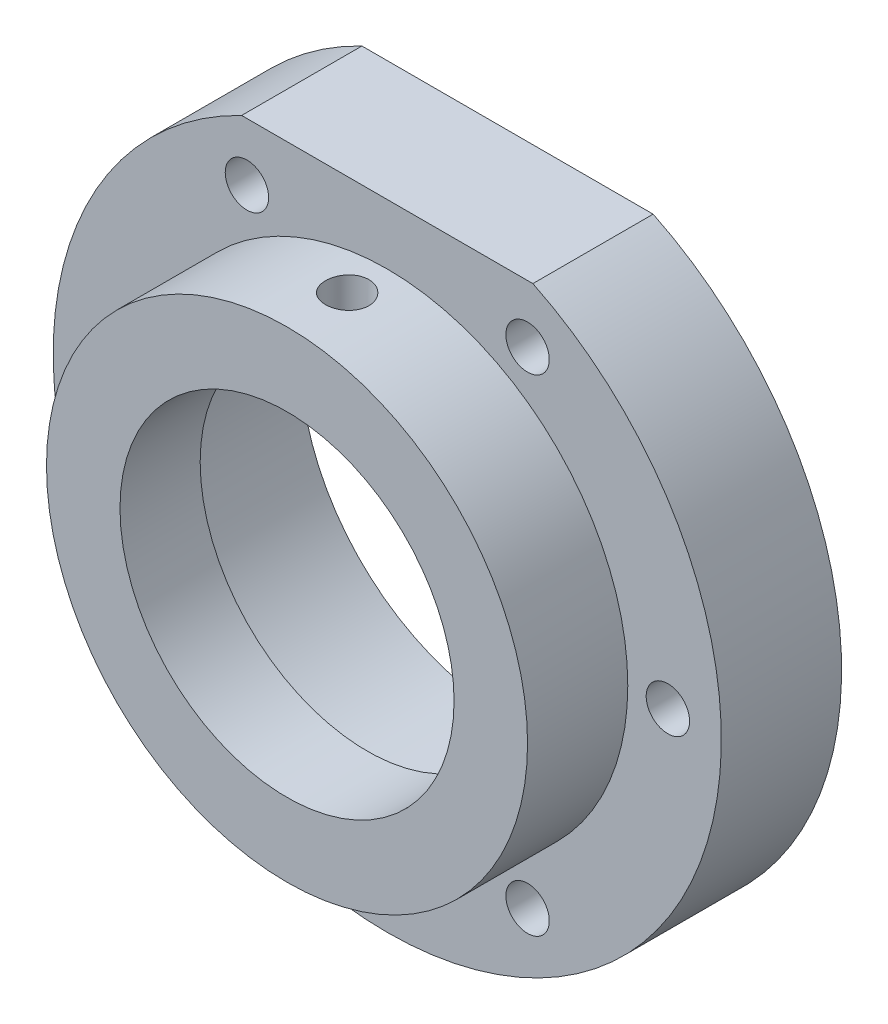
ISO-10303-21;
HEADER;
FILE_DESCRIPTION(('STEP AP214'),'2;1');
FILE_NAME('part.step','',(''),(''),'','','');
FILE_SCHEMA(('AUTOMOTIVE_DESIGN { 1 0 10303 214 1 1 1 1 }'));
ENDSEC;
DATA;
#1=APPLICATION_CONTEXT('core data for automotive mechanical design processes');
#2=APPLICATION_PROTOCOL_DEFINITION('international standard','automotive_design',2000,#1);
#3=PRODUCT_CONTEXT('',#1,'mechanical');
#4=PRODUCT('Part','Part','',(#3));
#5=PRODUCT_RELATED_PRODUCT_CATEGORY('part','',(#4));
#6=PRODUCT_DEFINITION_FORMATION('','',#4);
#7=PRODUCT_DEFINITION_CONTEXT('part definition',#1,'design');
#8=PRODUCT_DEFINITION('design','',#6,#7);
#9=PRODUCT_DEFINITION_SHAPE('','',#8);
#10=(LENGTH_UNIT() NAMED_UNIT(*) SI_UNIT(.MILLI.,.METRE.));
#11=(NAMED_UNIT(*) PLANE_ANGLE_UNIT() SI_UNIT($,.RADIAN.));
#12=(NAMED_UNIT(*) SI_UNIT($,.STERADIAN.) SOLID_ANGLE_UNIT());
#13=UNCERTAINTY_MEASURE_WITH_UNIT(LENGTH_MEASURE(1.E-05),#10,'distance_accuracy_value','');
#14=(GEOMETRIC_REPRESENTATION_CONTEXT(3) GLOBAL_UNCERTAINTY_ASSIGNED_CONTEXT((#13)) GLOBAL_UNIT_ASSIGNED_CONTEXT((#10,
#11,#12)) REPRESENTATION_CONTEXT('',''));
#15=CARTESIAN_POINT('',(0.,0.,0.));
#16=DIRECTION('',(0.,0.,1.));
#17=DIRECTION('',(1.,0.,0.));
#18=AXIS2_PLACEMENT_3D('',#15,#16,#17);
#19=CARTESIAN_POINT('',(-20.9999999999997,36.3730669589466,21.));
#20=DIRECTION('',(0.,0.,-1.));
#21=DIRECTION('',(0.499999999999992,-0.866025403784443,0.));
#22=AXIS2_PLACEMENT_3D('',#19,#20,#21);
#23=CYLINDRICAL_SURFACE('',#22,3.25);
#24=CARTESIAN_POINT('',(-20.9999999999997,36.3730669589466,18.));
#25=DIRECTION('',(0.,0.,1.));
#26=DIRECTION('',(-0.499999999999992,0.866025403784443,0.));
#27=AXIS2_PLACEMENT_3D('',#24,#25,#26);
#28=CIRCLE('',#27,3.25);
#29=CARTESIAN_POINT('',(-22.6249999999996,39.1876495212461,18.));
#30=VERTEX_POINT('',#29);
#31=EDGE_CURVE('E160',#30,#30,#28,.T.);
#32=ORIENTED_EDGE('',*,*,#31,.T.);
#33=EDGE_LOOP('',(#32));
#34=FACE_BOUND('',#33,.T.);
#35=CARTESIAN_POINT('',(-20.9999999999997,36.3730669589466,6.));
#36=DIRECTION('',(0.,0.,-1.));
#37=DIRECTION('',(-1.,0.,0.));
#38=AXIS2_PLACEMENT_3D('',#35,#36,#37);
#39=CIRCLE('',#38,3.25);
#40=CARTESIAN_POINT('',(-24.2499999999997,36.3730669589466,6.));
#41=VERTEX_POINT('',#40);
#42=EDGE_CURVE('E122',#41,#41,#39,.F.);
#43=ORIENTED_EDGE('',*,*,#42,.F.);
#44=EDGE_LOOP('',(#43));
#45=FACE_BOUND('',#44,.T.);
#46=ADVANCED_FACE('F34',(#34,#45),#23,.F.);
#47=CARTESIAN_POINT('',(-42.,0.,21.));
#48=DIRECTION('',(0.,0.,-1.));
#49=DIRECTION('',(1.,0.,0.));
#50=AXIS2_PLACEMENT_3D('',#47,#48,#49);
#51=CYLINDRICAL_SURFACE('',#50,3.25);
#52=CARTESIAN_POINT('',(-42.,0.,18.));
#53=DIRECTION('',(0.,0.,1.));
#54=DIRECTION('',(-1.,0.,0.));
#55=AXIS2_PLACEMENT_3D('',#52,#53,#54);
#56=CIRCLE('',#55,3.25);
#57=CARTESIAN_POINT('',(-45.25,0.,18.));
#58=VERTEX_POINT('',#57);
#59=EDGE_CURVE('E163',#58,#58,#56,.T.);
#60=ORIENTED_EDGE('',*,*,#59,.T.);
#61=EDGE_LOOP('',(#60));
#62=FACE_BOUND('',#61,.T.);
#63=CARTESIAN_POINT('',(-42.,0.,6.));
#64=DIRECTION('',(0.,0.,-1.));
#65=DIRECTION('',(-1.,0.,0.));
#66=AXIS2_PLACEMENT_3D('',#63,#64,#65);
#67=CIRCLE('',#66,3.25);
#68=CARTESIAN_POINT('',(-45.25,0.,6.));
#69=VERTEX_POINT('',#68);
#70=EDGE_CURVE('E118',#69,#69,#67,.F.);
#71=ORIENTED_EDGE('',*,*,#70,.F.);
#72=EDGE_LOOP('',(#71));
#73=FACE_BOUND('',#72,.T.);
#74=ADVANCED_FACE('F214',(#62,#73),#51,.F.);
#75=CARTESIAN_POINT('',(-21.0000000000002,-36.3730669589463,21.));
#76=DIRECTION('',(0.,0.,-1.));
#77=DIRECTION('',(0.500000000000004,0.866025403784436,0.));
#78=AXIS2_PLACEMENT_3D('',#75,#76,#77);
#79=CYLINDRICAL_SURFACE('',#78,3.25);
#80=CARTESIAN_POINT('',(-21.0000000000002,-36.3730669589463,18.));
#81=DIRECTION('',(0.,0.,1.));
#82=DIRECTION('',(-0.500000000000004,-0.866025403784436,0.));
#83=AXIS2_PLACEMENT_3D('',#80,#81,#82);
#84=CIRCLE('',#83,3.25);
#85=CARTESIAN_POINT('',(-22.6250000000002,-39.1876495212458,18.));
#86=VERTEX_POINT('',#85);
#87=EDGE_CURVE('E166',#86,#86,#84,.T.);
#88=ORIENTED_EDGE('',*,*,#87,.T.);
#89=EDGE_LOOP('',(#88));
#90=FACE_BOUND('',#89,.T.);
#91=CARTESIAN_POINT('',(-21.0000000000002,-36.3730669589463,6.));
#92=DIRECTION('',(0.,0.,-1.));
#93=DIRECTION('',(-1.,0.,0.));
#94=AXIS2_PLACEMENT_3D('',#91,#92,#93);
#95=CIRCLE('',#94,3.25);
#96=CARTESIAN_POINT('',(-24.2500000000002,-36.3730669589463,6.));
#97=VERTEX_POINT('',#96);
#98=EDGE_CURVE('E113',#97,#97,#95,.F.);
#99=ORIENTED_EDGE('',*,*,#98,.F.);
#100=EDGE_LOOP('',(#99));
#101=FACE_BOUND('',#100,.T.);
#102=ADVANCED_FACE('F220',(#90,#101),#79,.F.);
#103=CARTESIAN_POINT('',(20.9999999999999,-36.3730669589465,21.));
#104=DIRECTION('',(0.,0.,-1.));
#105=DIRECTION('',(-0.499999999999998,0.86602540378444,0.));
#106=AXIS2_PLACEMENT_3D('',#103,#104,#105);
#107=CYLINDRICAL_SURFACE('',#106,3.25);
#108=CARTESIAN_POINT('',(20.9999999999999,-36.3730669589465,18.));
#109=DIRECTION('',(0.,0.,1.));
#110=DIRECTION('',(0.499999999999998,-0.86602540378444,0.));
#111=AXIS2_PLACEMENT_3D('',#108,#109,#110);
#112=CIRCLE('',#111,3.25);
#113=CARTESIAN_POINT('',(22.6249999999999,-39.1876495212459,18.));
#114=VERTEX_POINT('',#113);
#115=EDGE_CURVE('E169',#114,#114,#112,.T.);
#116=ORIENTED_EDGE('',*,*,#115,.T.);
#117=EDGE_LOOP('',(#116));
#118=FACE_BOUND('',#117,.T.);
#119=CARTESIAN_POINT('',(20.9999999999999,-36.3730669589465,6.));
#120=DIRECTION('',(0.,0.,-1.));
#121=DIRECTION('',(-1.,0.,0.));
#122=AXIS2_PLACEMENT_3D('',#119,#120,#121);
#123=CIRCLE('',#122,3.25);
#124=CARTESIAN_POINT('',(17.7499999999999,-36.3730669589465,6.));
#125=VERTEX_POINT('',#124);
#126=EDGE_CURVE('E108',#125,#125,#123,.F.);
#127=ORIENTED_EDGE('',*,*,#126,.F.);
#128=EDGE_LOOP('',(#127));
#129=FACE_BOUND('',#128,.T.);
#130=ADVANCED_FACE('F229',(#118,#129),#107,.F.);
#131=CARTESIAN_POINT('',(42.,0.,21.));
#132=DIRECTION('',(0.,0.,-1.));
#133=DIRECTION('',(-1.,0.,0.));
#134=AXIS2_PLACEMENT_3D('',#131,#132,#133);
#135=CYLINDRICAL_SURFACE('',#134,3.25);
#136=CARTESIAN_POINT('',(42.,0.,18.));
#137=DIRECTION('',(0.,0.,1.));
#138=DIRECTION('',(1.,0.,0.));
#139=AXIS2_PLACEMENT_3D('',#136,#137,#138);
#140=CIRCLE('',#139,3.25);
#141=CARTESIAN_POINT('',(45.25,0.,18.));
#142=VERTEX_POINT('',#141);
#143=EDGE_CURVE('E172',#142,#142,#140,.T.);
#144=ORIENTED_EDGE('',*,*,#143,.T.);
#145=EDGE_LOOP('',(#144));
#146=FACE_BOUND('',#145,.T.);
#147=CARTESIAN_POINT('',(42.,0.,6.));
#148=DIRECTION('',(0.,0.,-1.));
#149=DIRECTION('',(-1.,0.,0.));
#150=AXIS2_PLACEMENT_3D('',#147,#148,#149);
#151=CIRCLE('',#150,3.25);
#152=CARTESIAN_POINT('',(38.75,0.,6.));
#153=VERTEX_POINT('',#152);
#154=EDGE_CURVE('E103',#153,#153,#151,.F.);
#155=ORIENTED_EDGE('',*,*,#154,.F.);
#156=EDGE_LOOP('',(#155));
#157=FACE_BOUND('',#156,.T.);
#158=ADVANCED_FACE('F233',(#146,#157),#135,.F.);
#159=CARTESIAN_POINT('',(21.0000000000004,36.3730669589462,21.));
#160=DIRECTION('',(0.,0.,-1.));
#161=DIRECTION('',(-0.50000000000001,-0.866025403784433,0.));
#162=AXIS2_PLACEMENT_3D('',#159,#160,#161);
#163=CYLINDRICAL_SURFACE('',#162,3.25);
#164=CARTESIAN_POINT('',(21.0000000000004,36.3730669589462,18.));
#165=DIRECTION('',(0.,0.,1.));
#166=DIRECTION('',(0.50000000000001,0.866025403784433,0.));
#167=AXIS2_PLACEMENT_3D('',#164,#165,#166);
#168=CIRCLE('',#167,3.25);
#169=CARTESIAN_POINT('',(22.6250000000005,39.1876495212456,18.));
#170=VERTEX_POINT('',#169);
#171=EDGE_CURVE('E101',#170,#170,#168,.T.);
#172=ORIENTED_EDGE('',*,*,#171,.T.);
#173=EDGE_LOOP('',(#172));
#174=FACE_BOUND('',#173,.T.);
#175=CARTESIAN_POINT('',(21.0000000000004,36.3730669589462,6.));
#176=DIRECTION('',(0.,0.,-1.));
#177=DIRECTION('',(-1.,0.,0.));
#178=AXIS2_PLACEMENT_3D('',#175,#176,#177);
#179=CIRCLE('',#178,3.25);
#180=CARTESIAN_POINT('',(17.7500000000004,36.3730669589462,6.));
#181=VERTEX_POINT('',#180);
#182=EDGE_CURVE('E98',#181,#181,#179,.F.);
#183=ORIENTED_EDGE('',*,*,#182,.F.);
#184=EDGE_LOOP('',(#183));
#185=FACE_BOUND('',#184,.T.);
#186=ADVANCED_FACE('F191',(#174,#185),#163,.F.);
#187=CARTESIAN_POINT('',(0.,0.,18.));
#188=DIRECTION('',(0.,0.,1.));
#189=DIRECTION('',(1.,0.,0.));
#190=AXIS2_PLACEMENT_3D('',#187,#188,#189);
#191=PLANE('',#190);
#192=ORIENTED_EDGE('',*,*,#171,.F.);
#193=EDGE_LOOP('',(#192));
#194=FACE_BOUND('',#193,.T.);
#195=ORIENTED_EDGE('',*,*,#31,.F.);
#196=EDGE_LOOP('',(#195));
#197=FACE_BOUND('',#196,.T.);
#198=ORIENTED_EDGE('',*,*,#59,.F.);
#199=EDGE_LOOP('',(#198));
#200=FACE_BOUND('',#199,.T.);
#201=ORIENTED_EDGE('',*,*,#87,.F.);
#202=EDGE_LOOP('',(#201));
#203=FACE_BOUND('',#202,.T.);
#204=ORIENTED_EDGE('',*,*,#115,.F.);
#205=EDGE_LOOP('',(#204));
#206=FACE_BOUND('',#205,.T.);
#207=ORIENTED_EDGE('',*,*,#143,.F.);
#208=EDGE_LOOP('',(#207));
#209=FACE_BOUND('',#208,.T.);
#210=CARTESIAN_POINT('',(0.,0.,18.));
#211=DIRECTION('',(0.,0.,1.));
#212=DIRECTION('',(1.,0.,0.));
#213=AXIS2_PLACEMENT_3D('',#210,#211,#212);
#214=CIRCLE('',#213,50.);
#215=CARTESIAN_POINT('',(-21.7944947177034,45.,18.));
#216=VERTEX_POINT('',#215);
#217=CARTESIAN_POINT('',(21.7944947177034,45.,18.));
#218=VERTEX_POINT('',#217);
#219=EDGE_CURVE('E83',#216,#218,#214,.T.);
#220=ORIENTED_EDGE('',*,*,#219,.T.);
#221=DIRECTION('',(-1.,0.,0.));
#222=VECTOR('',#221,1.);
#223=CARTESIAN_POINT('',(-21.7944947177034,45.,18.));
#224=LINE('',#223,#222);
#225=EDGE_CURVE('E62',#218,#216,#224,.T.);
#226=ORIENTED_EDGE('',*,*,#225,.T.);
#227=EDGE_LOOP('',(#220,#226));
#228=FACE_BOUND('',#227,.T.);
#229=CARTESIAN_POINT('',(0.,0.,18.));
#230=DIRECTION('',(0.,0.,1.));
#231=DIRECTION('',(1.,0.,0.));
#232=AXIS2_PLACEMENT_3D('',#229,#230,#231);
#233=CIRCLE('',#232,36.);
#234=CARTESIAN_POINT('',(36.,0.,18.));
#235=VERTEX_POINT('',#234);
#236=EDGE_CURVE('E92',#235,#235,#233,.T.);
#237=ORIENTED_EDGE('',*,*,#236,.F.);
#238=EDGE_LOOP('',(#237));
#239=FACE_BOUND('',#238,.T.);
#240=ADVANCED_FACE('F188',(#194,#197,#200,#203,#206,#209,#228,#239),#191,.T.);
#241=CARTESIAN_POINT('',(0.,0.,18.));
#242=DIRECTION('',(0.,0.,-1.));
#243=DIRECTION('',(-1.,0.,0.));
#244=AXIS2_PLACEMENT_3D('',#241,#242,#243);
#245=CYLINDRICAL_SURFACE('',#244,50.);
#246=CARTESIAN_POINT('',(0.,0.,0.));
#247=DIRECTION('',(0.,0.,1.));
#248=DIRECTION('',(1.,0.,0.));
#249=AXIS2_PLACEMENT_3D('',#246,#247,#248);
#250=CIRCLE('',#249,50.);
#251=CARTESIAN_POINT('',(-21.7944947177034,45.,0.));
#252=VERTEX_POINT('',#251);
#253=CARTESIAN_POINT('',(21.7944947177034,45.,0.));
#254=VERTEX_POINT('',#253);
#255=EDGE_CURVE('E84',#252,#254,#250,.T.);
#256=ORIENTED_EDGE('',*,*,#255,.T.);
#257=DIRECTION('',(0.,0.,-1.));
#258=VECTOR('',#257,1.);
#259=CARTESIAN_POINT('',(21.7944947177034,45.,18.));
#260=LINE('',#259,#258);
#261=EDGE_CURVE('E48',#218,#254,#260,.T.);
#262=ORIENTED_EDGE('',*,*,#261,.F.);
#263=ORIENTED_EDGE('',*,*,#219,.F.);
#264=DIRECTION('',(0.,0.,-1.));
#265=VECTOR('',#264,1.);
#266=CARTESIAN_POINT('',(-21.7944947177034,45.,18.));
#267=LINE('',#266,#265);
#268=EDGE_CURVE('E77',#216,#252,#267,.T.);
#269=ORIENTED_EDGE('',*,*,#268,.T.);
#270=EDGE_LOOP('',(#256,#262,#263,#269));
#271=FACE_BOUND('',#270,.T.);
#272=ADVANCED_FACE('F36',(#271),#245,.T.);
#273=CARTESIAN_POINT('',(-21.7944947177034,45.,18.));
#274=DIRECTION('',(0.,-1.,0.));
#275=DIRECTION('',(0.,0.,-1.));
#276=AXIS2_PLACEMENT_3D('',#273,#274,#275);
#277=PLANE('',#276);
#278=DIRECTION('',(-1.,0.,0.));
#279=VECTOR('',#278,1.);
#280=CARTESIAN_POINT('',(-21.7944947177034,45.,0.));
#281=LINE('',#280,#279);
#282=EDGE_CURVE('E74',#254,#252,#281,.T.);
#283=ORIENTED_EDGE('',*,*,#282,.T.);
#284=ORIENTED_EDGE('',*,*,#268,.F.);
#285=ORIENTED_EDGE('',*,*,#225,.F.);
#286=ORIENTED_EDGE('',*,*,#261,.T.);
#287=EDGE_LOOP('',(#283,#284,#285,#286));
#288=FACE_BOUND('',#287,.T.);
#289=ADVANCED_FACE('F76',(#288),#277,.F.);
#290=CARTESIAN_POINT('',(0.,0.,0.));
#291=DIRECTION('',(0.,0.,1.));
#292=DIRECTION('',(1.,0.,0.));
#293=AXIS2_PLACEMENT_3D('',#290,#291,#292);
#294=PLANE('',#293);
#295=CARTESIAN_POINT('',(-20.9999999999992,36.3730669589469,0.));
#296=DIRECTION('',(0.,0.,-1.));
#297=DIRECTION('',(-0.50000000000001,-0.866025403784433,0.));
#298=AXIS2_PLACEMENT_3D('',#295,#296,#297);
#299=CIRCLE('',#298,5.);
#300=CARTESIAN_POINT('',(-23.4999999999992,32.0429399400248,0.));
#301=VERTEX_POINT('',#300);
#302=EDGE_CURVE('E131',#301,#301,#299,.T.);
#303=ORIENTED_EDGE('',*,*,#302,.F.);
#304=EDGE_LOOP('',(#303));
#305=FACE_BOUND('',#304,.T.);
#306=CARTESIAN_POINT('',(-42.,8.77770078844264E-13,0.));
#307=DIRECTION('',(0.,0.,-1.));
#308=DIRECTION('',(0.499999999999992,-0.866025403784443,0.));
#309=AXIS2_PLACEMENT_3D('',#306,#307,#308);
#310=CIRCLE('',#309,5.);
#311=CARTESIAN_POINT('',(-39.5,-4.33012701892134,0.));
#312=VERTEX_POINT('',#311);
#313=EDGE_CURVE('E124',#312,#312,#310,.T.);
#314=ORIENTED_EDGE('',*,*,#313,.F.);
#315=EDGE_LOOP('',(#314));
#316=FACE_BOUND('',#315,.T.);
#317=CARTESIAN_POINT('',(-21.0000000000004,-36.3730669589462,0.));
#318=DIRECTION('',(0.,0.,-1.));
#319=DIRECTION('',(1.,0.,0.));
#320=AXIS2_PLACEMENT_3D('',#317,#318,#319);
#321=CIRCLE('',#320,5.);
#322=CARTESIAN_POINT('',(-16.0000000000004,-36.3730669589462,0.));
#323=VERTEX_POINT('',#322);
#324=EDGE_CURVE('E120',#323,#323,#321,.T.);
#325=ORIENTED_EDGE('',*,*,#324,.F.);
#326=EDGE_LOOP('',(#325));
#327=FACE_BOUND('',#326,.T.);
#328=CARTESIAN_POINT('',(20.9999999999994,-36.3730669589468,0.));
#329=DIRECTION('',(0.,0.,-1.));
#330=DIRECTION('',(0.500000000000004,0.866025403784436,0.));
#331=AXIS2_PLACEMENT_3D('',#328,#329,#330);
#332=CIRCLE('',#331,5.);
#333=CARTESIAN_POINT('',(23.4999999999994,-32.0429399400246,0.));
#334=VERTEX_POINT('',#333);
#335=EDGE_CURVE('E116',#334,#334,#332,.T.);
#336=ORIENTED_EDGE('',*,*,#335,.F.);
#337=EDGE_LOOP('',(#336));
#338=FACE_BOUND('',#337,.T.);
#339=CARTESIAN_POINT('',(42.,-5.86336534880161E-13,0.));
#340=DIRECTION('',(0.,0.,-1.));
#341=DIRECTION('',(-0.499999999999998,0.86602540378444,0.));
#342=AXIS2_PLACEMENT_3D('',#339,#340,#341);
#343=CIRCLE('',#342,5.);
#344=CARTESIAN_POINT('',(39.5,4.33012701892161,0.));
#345=VERTEX_POINT('',#344);
#346=EDGE_CURVE('E111',#345,#345,#343,.T.);
#347=ORIENTED_EDGE('',*,*,#346,.F.);
#348=EDGE_LOOP('',(#347));
#349=FACE_BOUND('',#348,.T.);
#350=CARTESIAN_POINT('',(21.0000000000004,36.3730669589462,0.));
#351=DIRECTION('',(0.,0.,-1.));
#352=DIRECTION('',(-1.,0.,0.));
#353=AXIS2_PLACEMENT_3D('',#350,#351,#352);
#354=CIRCLE('',#353,5.);
#355=CARTESIAN_POINT('',(16.0000000000004,36.3730669589462,0.));
#356=VERTEX_POINT('',#355);
#357=EDGE_CURVE('E106',#356,#356,#354,.T.);
#358=ORIENTED_EDGE('',*,*,#357,.F.);
#359=EDGE_LOOP('',(#358));
#360=FACE_BOUND('',#359,.T.);
#361=CARTESIAN_POINT('',(0.,0.,0.));
#362=DIRECTION('',(0.,0.,-1.));
#363=DIRECTION('',(-1.,0.,0.));
#364=AXIS2_PLACEMENT_3D('',#361,#362,#363);
#365=CIRCLE('',#364,31.);
#366=CARTESIAN_POINT('',(-31.,0.,0.));
#367=VERTEX_POINT('',#366);
#368=EDGE_CURVE('E181',#367,#367,#365,.T.);
#369=ORIENTED_EDGE('',*,*,#368,.F.);
#370=EDGE_LOOP('',(#369));
#371=FACE_BOUND('',#370,.T.);
#372=ORIENTED_EDGE('',*,*,#255,.F.);
#373=ORIENTED_EDGE('',*,*,#282,.F.);
#374=EDGE_LOOP('',(#372,#373));
#375=FACE_BOUND('',#374,.T.);
#376=ADVANCED_FACE('F88',(#305,#316,#327,#338,#349,#360,#371,#375),#294,.F.);
#377=CARTESIAN_POINT('',(0.,0.,33.));
#378=DIRECTION('',(0.,0.,-1.));
#379=DIRECTION('',(-1.,0.,0.));
#380=AXIS2_PLACEMENT_3D('',#377,#378,#379);
#381=CYLINDRICAL_SURFACE('',#380,36.);
#382=CARTESIAN_POINT('',(0.,36.,27.25));
#383=CARTESIAN_POINT('',(-0.182156100440259,35.9999980897112,27.2499920696433));
#384=CARTESIAN_POINT('',(-0.364434796640656,35.9986027451654,27.2346342323002));
#385=CARTESIAN_POINT('',(-0.723944882697687,35.9931706034735,27.1735971768418));
#386=CARTESIAN_POINT('',(-0.901170384079244,35.9891308463423,27.1278839800653));
#387=CARTESIAN_POINT('',(-1.24531551518541,35.9788661960098,27.0074724326335));
#388=CARTESIAN_POINT('',(-1.41224106651695,35.9726425723745,26.9327909197279));
#389=CARTESIAN_POINT('',(-1.73114900505232,35.9587073304558,26.7565938323107));
#390=CARTESIAN_POINT('',(-1.88313449066523,35.9509960216894,26.6550838379142));
#391=CARTESIAN_POINT('',(-2.16833696531753,35.9349245703837,26.427787325175));
#392=CARTESIAN_POINT('',(-2.30150352116119,35.9265627741039,26.3019376364945));
#393=CARTESIAN_POINT('',(-2.54485498105484,35.9101465694343,26.0296682167819));
#394=CARTESIAN_POINT('',(-2.65503885488034,35.9020921748373,25.8832475641255));
#395=CARTESIAN_POINT('',(-2.8494714297331,35.8871853440214,25.5736826666064));
#396=CARTESIAN_POINT('',(-2.93367523256743,35.880334997304,25.4105101126944));
#397=CARTESIAN_POINT('',(-3.07347068445882,35.8686315316397,25.0722701698966));
#398=CARTESIAN_POINT('',(-3.1290629180988,35.8637783718871,24.8972030241202));
#399=CARTESIAN_POINT('',(-3.20990946418039,35.8566331512853,24.5406528064155));
#400=CARTESIAN_POINT('',(-3.23524660902601,35.8543340990078,24.3591886588796));
#401=CARTESIAN_POINT('',(-3.25511970555985,35.8525354823989,23.9945698781849));
#402=CARTESIAN_POINT('',(-3.24965632653622,35.8530358572366,23.8114152818456));
#403=CARTESIAN_POINT('',(-3.20815184229905,35.8567731909202,23.4491836522511));
#404=CARTESIAN_POINT('',(-3.17220092373126,35.8600020783233,23.2700961904712));
#405=CARTESIAN_POINT('',(-3.07088207402955,35.8688199859752,22.9205075889362));
#406=CARTESIAN_POINT('',(-3.00551381196524,35.8744090327746,22.7500065457978));
#407=CARTESIAN_POINT('',(-2.84711542733471,35.8873268081878,22.4221442609398));
#408=CARTESIAN_POINT('',(-2.75404501983272,35.8946580672046,22.2648025856146));
#409=CARTESIAN_POINT('',(-2.54291327397535,35.9102319672594,21.9679394150259));
#410=CARTESIAN_POINT('',(-2.42485134045206,35.9184746300002,21.8284183442832));
#411=CARTESIAN_POINT('',(-2.16658289142722,35.9349785342179,21.5706326107821));
#412=CARTESIAN_POINT('',(-2.02629843999369,35.9432397362394,21.4524460132934));
#413=CARTESIAN_POINT('',(-1.72783850896349,35.9588218182368,21.2412882782751));
#414=CARTESIAN_POINT('',(-1.56966301449996,35.9661426974313,21.148317161699));
#415=CARTESIAN_POINT('',(-1.23985895547584,35.979021047551,20.9902336744414));
#416=CARTESIAN_POINT('',(-1.06822862884798,35.9845782870242,20.9251249599022));
#417=CARTESIAN_POINT('',(-0.716411021989144,35.9933006850736,20.8246701381165));
#418=CARTESIAN_POINT('',(-0.536223950330387,35.9964659019239,20.7893233058118));
#419=CARTESIAN_POINT('',(-0.173084117928063,36.0000401419034,20.7494939485925));
#420=CARTESIAN_POINT('',(0.00985672994628241,36.0004587903567,20.7449036365232));
#421=CARTESIAN_POINT('',(0.373905279120069,35.9985184712719,20.7664349668242));
#422=CARTESIAN_POINT('',(0.555013000514112,35.9961595342147,20.7925562721673));
#423=CARTESIAN_POINT('',(0.909945489006445,35.9889354275002,20.8746799778657));
#424=CARTESIAN_POINT('',(1.08378195524514,35.9840744655311,20.9306322167862));
#425=CARTESIAN_POINT('',(1.41960024712968,35.9723920788803,21.0707781532349));
#426=CARTESIAN_POINT('',(1.58158185401905,35.9655706180331,21.1549723717494));
#427=CARTESIAN_POINT('',(1.88958163171699,35.9507072641443,21.3494817676767));
#428=CARTESIAN_POINT('',(2.03555469205854,35.942662067482,21.4598681197434));
#429=CARTESIAN_POINT('',(2.30693787443107,35.9262655600466,21.7035258067755));
#430=CARTESIAN_POINT('',(2.43234757678719,35.9179142430304,21.8367976086934));
#431=CARTESIAN_POINT('',(2.65941563964451,35.9018180572516,22.122911854177));
#432=CARTESIAN_POINT('',(2.76100350221454,35.8940750325243,22.2758103650361));
#433=CARTESIAN_POINT('',(2.93706030683788,35.880099075336,22.5965597291097));
#434=CARTESIAN_POINT('',(3.01152955964053,35.8738661255715,22.7644104109614));
#435=CARTESIAN_POINT('',(3.13111596159382,35.863626902366,23.1100529335847));
#436=CARTESIAN_POINT('',(3.17627578805002,35.8596173926302,23.287829908928));
#437=CARTESIAN_POINT('',(3.23610018108755,35.854268532553,23.6484810244242));
#438=CARTESIAN_POINT('',(3.25076544678064,35.8529291209975,23.8313550476258));
#439=CARTESIAN_POINT('',(3.24917571832654,35.8530731721428,24.1963085138651));
#440=CARTESIAN_POINT('',(3.23303147978938,35.8545465233845,24.3783884535409));
#441=CARTESIAN_POINT('',(3.17051247027981,35.8601285782222,24.7372391185164));
#442=CARTESIAN_POINT('',(3.12413765757602,35.8642372854562,24.9140098364868));
#443=CARTESIAN_POINT('',(3.0025029879182,35.8746243894097,25.2572281516232));
#444=CARTESIAN_POINT('',(2.92724563802665,35.8809025978074,25.4236766433231));
#445=CARTESIAN_POINT('',(2.74999410775203,35.8949216672063,25.7415956781271));
#446=CARTESIAN_POINT('',(2.64800023996935,35.9026625111062,25.8930663963212));
#447=CARTESIAN_POINT('',(2.41975448504357,35.9187678697272,26.1772975244273));
#448=CARTESIAN_POINT('',(2.2934203131536,35.927134439342,26.3099917414429));
#449=CARTESIAN_POINT('',(2.02023604592843,35.9435297345547,26.5523501650229));
#450=CARTESIAN_POINT('',(1.87338101409431,35.9515583782546,26.6620088142133));
#451=CARTESIAN_POINT('',(1.56299341468707,35.9663902216639,26.8553574949875));
#452=CARTESIAN_POINT('',(1.39942619791849,35.9731907910472,26.9389920578875));
#453=CARTESIAN_POINT('',(1.06061772498824,35.9847704375452,27.0775006100208));
#454=CARTESIAN_POINT('',(0.885390045681955,35.9895518196268,27.1324074101247));
#455=CARTESIAN_POINT('',(0.590954012014774,35.9953371549821,27.1980332930476));
#456=CARTESIAN_POINT('',(0.473634898520523,35.9970776855389,27.2174946220197));
#457=CARTESIAN_POINT('',(0.237561237565138,35.9994097291717,27.2434805409118));
#458=CARTESIAN_POINT('',(0.118806694714676,36.0000012459374,27.2500051723739));
#459=CARTESIAN_POINT('',(0.,36.,27.25));
#460=B_SPLINE_CURVE_WITH_KNOTS('',3,(#382,#383,#384,#385,#386,#387,#388,#389,#390,#391,#392,
#393,#394,#395,#396,#397,#398,#399,#400,#401,#402,#403,#404,#405,#406,#407,#408,#409,#410,#411,
#412,#413,#414,#415,#416,#417,#418,#419,#420,#421,#422,#423,#424,#425,#426,#427,#428,#429,#430,
#431,#432,#433,#434,#435,#436,#437,#438,#439,#440,#441,#442,#443,#444,#445,#446,#447,#448,#449,
#450,#451,#452,#453,#454,#455,#456,#457,#458,#459),.UNSPECIFIED.,.T.,.F.,(4,2,2,2,2,2,2,2,2,2,2,
2,2,2,2,2,2,2,2,2,2,2,2,2,2,2,2,2,2,2,2,2,2,2,2,2,2,2,4),(0.,0.546034502312107,1.09268124798954,
1.63901073180533,2.18522667264922,2.73287974149896,3.28055735423782,3.82917621753161,
4.37778387116595,4.92488607722722,5.47197639493219,6.01745396136612,6.56293766430319,
7.109218527179,7.65551240108216,8.20376640487595,8.75202086425443,9.30034724428469,
9.84866026561351,10.3950506977285,10.9414351338497,11.4869036957372,12.0323823205625,
12.5793605595347,13.1263499603245,13.6749382394453,14.2235202321522,14.7713016345849,
15.3190704785599,15.8648738832228,16.4106780413339,16.9564348332548,17.5021852445327,
18.0498140592841,18.5975748391668,19.1464952631087,19.6947873718226,20.0509256652,
20.4070628149473),.UNSPECIFIED.);
#461=CARTESIAN_POINT('',(0.,36.,27.25));
#462=VERTEX_POINT('',#461);
#463=EDGE_CURVE('E136',#462,#462,#460,.T.);
#464=ORIENTED_EDGE('',*,*,#463,.T.);
#465=EDGE_LOOP('',(#464));
#466=FACE_BOUND('',#465,.T.);
#467=CARTESIAN_POINT('',(0.,0.,33.));
#468=DIRECTION('',(0.,0.,1.));
#469=DIRECTION('',(1.,0.,0.));
#470=AXIS2_PLACEMENT_3D('',#467,#468,#469);
#471=CIRCLE('',#470,36.);
#472=CARTESIAN_POINT('',(36.,0.,33.));
#473=VERTEX_POINT('',#472);
#474=EDGE_CURVE('E89',#473,#473,#471,.T.);
#475=ORIENTED_EDGE('',*,*,#474,.F.);
#476=EDGE_LOOP('',(#475));
#477=FACE_BOUND('',#476,.T.);
#478=ORIENTED_EDGE('',*,*,#236,.T.);
#479=EDGE_LOOP('',(#478));
#480=FACE_BOUND('',#479,.T.);
#481=ADVANCED_FACE('F196',(#466,#477,#480),#381,.T.);
#482=CARTESIAN_POINT('',(0.,0.,33.));
#483=DIRECTION('',(0.,0.,1.));
#484=DIRECTION('',(1.,0.,0.));
#485=AXIS2_PLACEMENT_3D('',#482,#483,#484);
#486=PLANE('',#485);
#487=CARTESIAN_POINT('',(0.,0.,33.));
#488=DIRECTION('',(0.,0.,1.));
#489=DIRECTION('',(1.,0.,0.));
#490=AXIS2_PLACEMENT_3D('',#487,#488,#489);
#491=CIRCLE('',#490,25.);
#492=CARTESIAN_POINT('',(25.,0.,33.));
#493=VERTEX_POINT('',#492);
#494=EDGE_CURVE('E178',#493,#493,#491,.T.);
#495=ORIENTED_EDGE('',*,*,#494,.F.);
#496=EDGE_LOOP('',(#495));
#497=FACE_BOUND('',#496,.T.);
#498=ORIENTED_EDGE('',*,*,#474,.T.);
#499=EDGE_LOOP('',(#498));
#500=FACE_BOUND('',#499,.T.);
#501=ADVANCED_FACE('F198',(#497,#500),#486,.T.);
#502=CARTESIAN_POINT('',(0.,0.,21.));
#503=DIRECTION('',(0.,0.,-1.));
#504=DIRECTION('',(-1.,0.,0.));
#505=AXIS2_PLACEMENT_3D('',#502,#503,#504);
#506=CYLINDRICAL_SURFACE('',#505,31.);
#507=CARTESIAN_POINT('',(0.,0.,21.));
#508=DIRECTION('',(0.,0.,-1.));
#509=DIRECTION('',(-1.,0.,0.));
#510=AXIS2_PLACEMENT_3D('',#507,#508,#509);
#511=CIRCLE('',#510,31.);
#512=CARTESIAN_POINT('',(1.25,30.9747881348687,21.));
#513=VERTEX_POINT('',#512);
#514=CARTESIAN_POINT('',(-1.25,30.9747881348687,21.));
#515=VERTEX_POINT('',#514);
#516=EDGE_CURVE('E182',#513,#515,#511,.T.);
#517=ORIENTED_EDGE('',*,*,#516,.F.);
#518=CARTESIAN_POINT('',(1.25,30.9747881348687,21.));
#519=CARTESIAN_POINT('',(1.16610114716421,30.9781771397317,20.9650325282778));
#520=CARTESIAN_POINT('',(1.08072180312543,30.98127809214,20.9335982027399));
#521=CARTESIAN_POINT('',(0.907611423314064,30.9868308912873,20.8779826953842));
#522=CARTESIAN_POINT('',(0.819880373243734,30.9892827340789,20.8538015576747));
#523=CARTESIAN_POINT('',(0.642625704867075,30.9934654784807,20.8128678829141));
#524=CARTESIAN_POINT('',(0.553101079945208,30.9951959626445,20.7961196468819));
#525=CARTESIAN_POINT('',(0.372978392400429,30.9978873354851,20.7701895919849));
#526=CARTESIAN_POINT('',(0.282380388692591,30.9988482662039,20.7610073597749));
#527=CARTESIAN_POINT('',(0.00979279986852493,31.0005286561882,20.7449288128395));
#528=CARTESIAN_POINT('',(-0.173006944202908,31.0000461127556,20.7494968345788));
#529=CARTESIAN_POINT('',(-0.534887117172541,30.9959125142427,20.7891653671907));
#530=CARTESIAN_POINT('',(-0.713974083105198,30.9922676179497,20.8242065309155));
#531=CARTESIAN_POINT('',(-0.95010958614875,30.9854984851585,20.8913197500217));
#532=CARTESIAN_POINT('',(-1.01102576932304,30.9835678992944,20.9105964941071));
#533=CARTESIAN_POINT('',(-1.13152747727526,30.979400603201,20.9526726484633));
#534=CARTESIAN_POINT('',(-1.19111466594333,30.9771643040301,20.9754673337728));
#535=CARTESIAN_POINT('',(-1.25,30.9747881348687,21.));
#536=B_SPLINE_CURVE_WITH_KNOTS('',3,(#518,#519,#520,#521,#522,#523,#524,#525,#526,#527,#528,
#529,#530,#531,#532,#533,#534,#535),.UNSPECIFIED.,.F.,.F.,(4,2,2,2,2,2,2,2,4),(0.,
0.272785402657875,0.545572464154748,0.818517167641767,1.09144695864944,1.63725613823091,
2.18200471631786,2.37368731880413,2.56511467682559),.UNSPECIFIED.);
#537=EDGE_CURVE('E251',#513,#515,#536,.T.);
#538=ORIENTED_EDGE('',*,*,#537,.T.);
#539=EDGE_LOOP('',(#517,#538));
#540=FACE_BOUND('',#539,.T.);
#541=ORIENTED_EDGE('',*,*,#368,.T.);
#542=EDGE_LOOP('',(#541));
#543=FACE_BOUND('',#542,.T.);
#544=ADVANCED_FACE('F205',(#540,#543),#506,.F.);
#545=CARTESIAN_POINT('',(0.,0.,21.));
#546=DIRECTION('',(0.,0.,-1.));
#547=DIRECTION('',(-1.,0.,0.));
#548=AXIS2_PLACEMENT_3D('',#545,#546,#547);
#549=PLANE('',#548);
#550=DIRECTION('',(0.,1.,0.));
#551=VECTOR('',#550,1.);
#552=CARTESIAN_POINT('',(-1.25,18.,21.));
#553=LINE('',#552,#551);
#554=CARTESIAN_POINT('',(-1.25000000000002,24.9687304442977,21.));
#555=VERTEX_POINT('',#554);
#556=EDGE_CURVE('E258',#555,#515,#553,.T.);
#557=ORIENTED_EDGE('',*,*,#556,.F.);
#558=CARTESIAN_POINT('',(0.,0.,21.));
#559=DIRECTION('',(0.,0.,-1.));
#560=DIRECTION('',(-1.,0.,0.));
#561=AXIS2_PLACEMENT_3D('',#558,#559,#560);
#562=CIRCLE('',#561,25.);
#563=CARTESIAN_POINT('',(1.25,24.9687304442977,21.));
#564=VERTEX_POINT('',#563);
#565=EDGE_CURVE('E175',#564,#555,#562,.T.);
#566=ORIENTED_EDGE('',*,*,#565,.F.);
#567=DIRECTION('',(0.,1.,0.));
#568=VECTOR('',#567,1.);
#569=CARTESIAN_POINT('',(1.25,18.,21.));
#570=LINE('',#569,#568);
#571=EDGE_CURVE('E55',#513,#564,#570,.F.);
#572=ORIENTED_EDGE('',*,*,#571,.F.);
#573=ORIENTED_EDGE('',*,*,#516,.T.);
#574=EDGE_LOOP('',(#557,#566,#572,#573));
#575=FACE_BOUND('',#574,.T.);
#576=ADVANCED_FACE('F242',(#575),#549,.T.);
#577=CARTESIAN_POINT('',(0.,0.,42.));
#578=DIRECTION('',(0.,0.,-1.));
#579=DIRECTION('',(-1.,0.,0.));
#580=AXIS2_PLACEMENT_3D('',#577,#578,#579);
#581=CYLINDRICAL_SURFACE('',#580,25.);
#582=ORIENTED_EDGE('',*,*,#494,.T.);
#583=EDGE_LOOP('',(#582));
#584=FACE_BOUND('',#583,.T.);
#585=ORIENTED_EDGE('',*,*,#565,.T.);
#586=CARTESIAN_POINT('',(-1.25000000000002,24.9687304442977,21.));
#587=CARTESIAN_POINT('',(-1.33452280574835,24.9645021185908,21.0352085890344));
#588=CARTESIAN_POINT('',(-1.41753023472184,24.9599132129076,21.0739960842154));
#589=CARTESIAN_POINT('',(-1.57994762223733,24.950157178817,21.1584111337587));
#590=CARTESIAN_POINT('',(-1.65935786289263,24.9449900958643,21.2040381505106));
#591=CARTESIAN_POINT('',(-1.81397321014505,24.9342237235774,21.3017857273168));
#592=CARTESIAN_POINT('',(-1.88918123566437,24.9286247408481,21.3539016967238));
#593=CARTESIAN_POINT('',(-2.03490958399238,24.9171525250347,21.4642539174397));
#594=CARTESIAN_POINT('',(-2.10542991904332,24.9112792926667,21.522490152764));
#595=CARTESIAN_POINT('',(-2.30925672361935,24.8934910966523,21.7058418005161));
#596=CARTESIAN_POINT('',(-2.43491401390479,24.8814014369299,21.8396540204128));
#597=CARTESIAN_POINT('',(-2.66190934602541,24.8581441139953,22.1264407225932));
#598=CARTESIAN_POINT('',(-2.7632514918197,24.8469762954019,22.2794119645355));
#599=CARTESIAN_POINT('',(-2.93894452566896,24.8268091515159,22.600498202673));
#600=CARTESIAN_POINT('',(-3.01326935797399,24.8178119223571,22.7686276236127));
#601=CARTESIAN_POINT('',(-3.13258899163469,24.8030347568693,23.1151433841427));
#602=CARTESIAN_POINT('',(-3.17758120041457,24.7972551049339,23.293530628859));
#603=CARTESIAN_POINT('',(-3.23667730036323,24.7896109765301,23.6541911510472));
#604=CARTESIAN_POINT('',(-3.25098835381582,24.7877202452201,23.8364299210746));
#605=CARTESIAN_POINT('',(-3.24890551506016,24.7879933631759,24.2007143075935));
#606=CARTESIAN_POINT('',(-3.23251434982084,24.7901568523461,24.3827599398026));
#607=CARTESIAN_POINT('',(-3.16968168046547,24.7982680690398,24.7405773883119));
#608=CARTESIAN_POINT('',(-3.12338716314559,24.8041972841555,24.9163754782014));
#609=CARTESIAN_POINT('',(-3.00224563283807,24.8191502741346,25.2577042924326));
#610=CARTESIAN_POINT('',(-2.92739719148814,24.8281742038036,25.4232345026591));
#611=CARTESIAN_POINT('',(-2.75088024126711,24.8483510898859,25.7401760142298));
#612=CARTESIAN_POINT('',(-2.64908972866009,24.8595136657266,25.8915187371341));
#613=CARTESIAN_POINT('',(-2.42170963796773,24.8826916915247,26.1750515356695));
#614=CARTESIAN_POINT('',(-2.29611908558818,24.8947071763848,26.307240826832));
#615=CARTESIAN_POINT('',(-2.0236634166606,24.9183380976952,26.54965948954));
#616=CARTESIAN_POINT('',(-1.87665699736092,24.9299501876244,26.6597304504351));
#617=CARTESIAN_POINT('',(-1.56613261720319,24.9513809862998,26.8536350979285));
#618=CARTESIAN_POINT('',(-1.40261480825262,24.961199711543,26.9374690258827));
#619=CARTESIAN_POINT('',(-1.06392366631238,24.9779251116102,27.0763640307557));
#620=CARTESIAN_POINT('',(-0.888768028338762,24.9848360953427,27.1314677114944));
#621=CARTESIAN_POINT('',(-0.531586055268374,24.994985775913,27.2114491473005));
#622=CARTESIAN_POINT('',(-0.349560079754719,24.9982246646681,27.236328482009));
#623=CARTESIAN_POINT('',(0.0147378188767514,25.0006542819049,27.2550423980871));
#624=CARTESIAN_POINT('',(0.19699771363937,24.9998751151208,27.2491078460115));
#625=CARTESIAN_POINT('',(0.55790812241962,24.9944257318688,27.2069061857806));
#626=CARTESIAN_POINT('',(0.736558678589909,24.98975556087,27.1706394320783));
#627=CARTESIAN_POINT('',(1.08486346083212,24.9770576395462,27.0689456097477));
#628=CARTESIAN_POINT('',(1.2545337645284,24.9690361352911,27.0035727729681));
#629=CARTESIAN_POINT('',(1.58052219566399,24.9505237356996,26.8455688480637));
#630=CARTESIAN_POINT('',(1.73683973370114,24.9400327314341,26.7529365574854));
#631=CARTESIAN_POINT('',(2.03280592891191,24.9176624919545,26.5423229266985));
#632=CARTESIAN_POINT('',(2.17233755632599,24.9057745376663,26.4241780526015));
#633=CARTESIAN_POINT('',(2.42966387284034,24.8819908557177,26.1662013267181));
#634=CARTESIAN_POINT('',(2.54745783704029,24.8700951278114,26.0263687519837));
#635=CARTESIAN_POINT('',(2.75854127281185,24.8475714917009,25.728145095483));
#636=CARTESIAN_POINT('',(2.85170672946742,24.836950141581,25.5696656881399));
#637=CARTESIAN_POINT('',(3.01007536382824,24.8182561386641,25.239161592221));
#638=CARTESIAN_POINT('',(3.0752793866133,24.8101834088419,25.0671373131986));
#639=CARTESIAN_POINT('',(3.17557433273391,24.7975461061604,24.7152286581527));
#640=CARTESIAN_POINT('',(3.2107983595048,24.7929660363276,24.5353827905493));
#641=CARTESIAN_POINT('',(3.25056510518478,24.787784081428,24.1722768574962));
#642=CARTESIAN_POINT('',(3.25510920601012,24.7871820171798,23.9890169461982));
#643=CARTESIAN_POINT('',(3.23345859616237,24.7900152412111,23.6256397666652));
#644=CARTESIAN_POINT('',(3.20747739905303,24.7934224860588,23.4455095070665));
#645=CARTESIAN_POINT('',(3.12590386293055,24.8038383443677,23.0922039989761));
#646=CARTESIAN_POINT('',(3.07031268297466,24.8108468168615,22.9190284785322));
#647=CARTESIAN_POINT('',(2.93105202619569,24.8276827903396,22.5842493307442));
#648=CARTESIAN_POINT('',(2.84734564995986,24.8375139935045,22.4226612511533));
#649=CARTESIAN_POINT('',(2.65421085089281,24.8588930802295,22.1157096428586));
#650=CARTESIAN_POINT('',(2.5447730307939,24.870441590392,21.9703520702995));
#651=CARTESIAN_POINT('',(2.30227387684925,24.8940652093759,21.6988121113023));
#652=CARTESIAN_POINT('',(2.16902586251131,24.9061438648224,21.5727970575376));
#653=CARTESIAN_POINT('',(1.88330912126096,24.9293713997905,21.3450201997023));
#654=CARTESIAN_POINT('',(1.73086985535222,24.9405216618281,21.2432218976569));
#655=CARTESIAN_POINT('',(1.51904260784204,24.9538626614816,21.1262269748161));
#656=CARTESIAN_POINT('',(1.46617084104486,24.9570277248271,21.0988978194184));
#657=CARTESIAN_POINT('',(1.35908278352796,24.9630878800156,21.0472195373729));
#658=CARTESIAN_POINT('',(1.30486884627171,24.9659834071661,21.0228655851023));
#659=CARTESIAN_POINT('',(1.25000000000002,24.9687304442977,21.));
#660=B_SPLINE_CURVE_WITH_KNOTS('',3,(#586,#587,#588,#589,#590,#591,#592,#593,#594,#595,#596,
#597,#598,#599,#600,#601,#602,#603,#604,#605,#606,#607,#608,#609,#610,#611,#612,#613,#614,#615,
#616,#617,#618,#619,#620,#621,#622,#623,#624,#625,#626,#627,#628,#629,#630,#631,#632,#633,#634,
#635,#636,#637,#638,#639,#640,#641,#642,#643,#644,#645,#646,#647,#648,#649,#650,#651,#652,#653,
#654,#655,#656,#657,#658,#659),.UNSPECIFIED.,.F.,.F.,(4,2,2,2,2,2,2,2,2,2,2,2,2,2,2,2,2,2,2,2,2,
2,2,2,2,2,2,2,2,2,2,2,2,2,2,2,4),(0.,0.274888833374034,0.549756070844399,0.824429945156292,
1.099103102109,1.6481506986484,2.19710556053547,2.74658844377243,3.2961198866944,
3.84192899634266,4.38768962956246,4.93078783976948,5.47391322111946,6.01954145250227,
6.56519202491121,7.11462120430084,7.66404532931261,8.21265238434524,8.76123076581969,
9.30570499748399,9.85017286667559,10.393630475322,10.9371120602557,11.4841865984656,
12.0312793770388,12.5810766722144,13.1308573496678,13.678184217628,14.2254864321732,
14.768983142226,15.3124585791319,15.8566500984752,16.4010406691595,16.9499033802494,
17.4979335633604,17.6766729124249,17.8551183942572),.UNSPECIFIED.);
#661=EDGE_CURVE('E11',#555,#564,#660,.T.);
#662=ORIENTED_EDGE('',*,*,#661,.T.);
#663=EDGE_LOOP('',(#585,#662));
#664=FACE_BOUND('',#663,.T.);
#665=ADVANCED_FACE('F237',(#584,#664),#581,.F.);
#666=CARTESIAN_POINT('',(21.0000000000004,36.3730669589462,6.));
#667=DIRECTION('',(0.,0.,-1.));
#668=DIRECTION('',(-1.,0.,0.));
#669=AXIS2_PLACEMENT_3D('',#666,#667,#668);
#670=PLANE('',#669);
#671=CARTESIAN_POINT('',(21.0000000000004,36.3730669589462,6.));
#672=DIRECTION('',(0.,0.,-1.));
#673=DIRECTION('',(-1.,0.,0.));
#674=AXIS2_PLACEMENT_3D('',#671,#672,#673);
#675=CIRCLE('',#674,5.);
#676=CARTESIAN_POINT('',(16.0000000000004,36.3730669589462,6.));
#677=VERTEX_POINT('',#676);
#678=EDGE_CURVE('E102',#677,#677,#675,.T.);
#679=ORIENTED_EDGE('',*,*,#678,.T.);
#680=EDGE_LOOP('',(#679));
#681=FACE_BOUND('',#680,.T.);
#682=ORIENTED_EDGE('',*,*,#182,.T.);
#683=EDGE_LOOP('',(#682));
#684=FACE_BOUND('',#683,.T.);
#685=ADVANCED_FACE('F241',(#681,#684),#670,.T.);
#686=CARTESIAN_POINT('',(21.0000000000004,36.3730669589462,6.));
#687=DIRECTION('',(0.,0.,-1.));
#688=DIRECTION('',(-1.,0.,0.));
#689=AXIS2_PLACEMENT_3D('',#686,#687,#688);
#690=CYLINDRICAL_SURFACE('',#689,5.);
#691=ORIENTED_EDGE('',*,*,#678,.F.);
#692=EDGE_LOOP('',(#691));
#693=FACE_BOUND('',#692,.T.);
#694=ORIENTED_EDGE('',*,*,#357,.T.);
#695=EDGE_LOOP('',(#694));
#696=FACE_BOUND('',#695,.T.);
#697=ADVANCED_FACE('F307',(#693,#696),#690,.F.);
#698=CARTESIAN_POINT('',(42.,-5.86336534880161E-13,6.));
#699=DIRECTION('',(0.,0.,-1.));
#700=DIRECTION('',(-0.499999999999998,0.86602540378444,0.));
#701=AXIS2_PLACEMENT_3D('',#698,#699,#700);
#702=PLANE('',#701);
#703=CARTESIAN_POINT('',(42.,-5.86336534880161E-13,6.));
#704=DIRECTION('',(0.,0.,-1.));
#705=DIRECTION('',(-0.499999999999998,0.86602540378444,0.));
#706=AXIS2_PLACEMENT_3D('',#703,#704,#705);
#707=CIRCLE('',#706,5.);
#708=CARTESIAN_POINT('',(39.5,4.33012701892161,6.));
#709=VERTEX_POINT('',#708);
#710=EDGE_CURVE('E107',#709,#709,#707,.T.);
#711=ORIENTED_EDGE('',*,*,#710,.T.);
#712=EDGE_LOOP('',(#711));
#713=FACE_BOUND('',#712,.T.);
#714=ORIENTED_EDGE('',*,*,#154,.T.);
#715=EDGE_LOOP('',(#714));
#716=FACE_BOUND('',#715,.T.);
#717=ADVANCED_FACE('F303',(#713,#716),#702,.T.);
#718=CARTESIAN_POINT('',(42.,-5.86336534880161E-13,6.));
#719=DIRECTION('',(0.,0.,-1.));
#720=DIRECTION('',(-0.499999999999998,0.86602540378444,0.));
#721=AXIS2_PLACEMENT_3D('',#718,#719,#720);
#722=CYLINDRICAL_SURFACE('',#721,5.);
#723=ORIENTED_EDGE('',*,*,#710,.F.);
#724=EDGE_LOOP('',(#723));
#725=FACE_BOUND('',#724,.T.);
#726=ORIENTED_EDGE('',*,*,#346,.T.);
#727=EDGE_LOOP('',(#726));
#728=FACE_BOUND('',#727,.T.);
#729=ADVANCED_FACE('F299',(#725,#728),#722,.F.);
#730=CARTESIAN_POINT('',(20.9999999999994,-36.3730669589468,6.));
#731=DIRECTION('',(0.,0.,-1.));
#732=DIRECTION('',(0.500000000000004,0.866025403784436,0.));
#733=AXIS2_PLACEMENT_3D('',#730,#731,#732);
#734=PLANE('',#733);
#735=CARTESIAN_POINT('',(20.9999999999994,-36.3730669589468,6.));
#736=DIRECTION('',(0.,0.,-1.));
#737=DIRECTION('',(0.500000000000004,0.866025403784436,0.));
#738=AXIS2_PLACEMENT_3D('',#735,#736,#737);
#739=CIRCLE('',#738,5.);
#740=CARTESIAN_POINT('',(23.4999999999994,-32.0429399400246,6.));
#741=VERTEX_POINT('',#740);
#742=EDGE_CURVE('E112',#741,#741,#739,.T.);
#743=ORIENTED_EDGE('',*,*,#742,.T.);
#744=EDGE_LOOP('',(#743));
#745=FACE_BOUND('',#744,.T.);
#746=ORIENTED_EDGE('',*,*,#126,.T.);
#747=EDGE_LOOP('',(#746));
#748=FACE_BOUND('',#747,.T.);
#749=ADVANCED_FACE('F295',(#745,#748),#734,.T.);
#750=CARTESIAN_POINT('',(20.9999999999994,-36.3730669589468,6.));
#751=DIRECTION('',(0.,0.,-1.));
#752=DIRECTION('',(0.500000000000004,0.866025403784436,0.));
#753=AXIS2_PLACEMENT_3D('',#750,#751,#752);
#754=CYLINDRICAL_SURFACE('',#753,5.);
#755=ORIENTED_EDGE('',*,*,#742,.F.);
#756=EDGE_LOOP('',(#755));
#757=FACE_BOUND('',#756,.T.);
#758=ORIENTED_EDGE('',*,*,#335,.T.);
#759=EDGE_LOOP('',(#758));
#760=FACE_BOUND('',#759,.T.);
#761=ADVANCED_FACE('F291',(#757,#760),#754,.F.);
#762=CARTESIAN_POINT('',(-21.0000000000004,-36.3730669589462,6.));
#763=DIRECTION('',(0.,0.,-1.));
#764=DIRECTION('',(1.,0.,0.));
#765=AXIS2_PLACEMENT_3D('',#762,#763,#764);
#766=PLANE('',#765);
#767=CARTESIAN_POINT('',(-21.0000000000004,-36.3730669589462,6.));
#768=DIRECTION('',(0.,0.,-1.));
#769=DIRECTION('',(1.,0.,0.));
#770=AXIS2_PLACEMENT_3D('',#767,#768,#769);
#771=CIRCLE('',#770,5.);
#772=CARTESIAN_POINT('',(-16.0000000000004,-36.3730669589462,6.));
#773=VERTEX_POINT('',#772);
#774=EDGE_CURVE('E117',#773,#773,#771,.T.);
#775=ORIENTED_EDGE('',*,*,#774,.T.);
#776=EDGE_LOOP('',(#775));
#777=FACE_BOUND('',#776,.T.);
#778=ORIENTED_EDGE('',*,*,#98,.T.);
#779=EDGE_LOOP('',(#778));
#780=FACE_BOUND('',#779,.T.);
#781=ADVANCED_FACE('F287',(#777,#780),#766,.T.);
#782=CARTESIAN_POINT('',(-21.0000000000004,-36.3730669589462,6.));
#783=DIRECTION('',(0.,0.,-1.));
#784=DIRECTION('',(1.,0.,0.));
#785=AXIS2_PLACEMENT_3D('',#782,#783,#784);
#786=CYLINDRICAL_SURFACE('',#785,5.);
#787=ORIENTED_EDGE('',*,*,#774,.F.);
#788=EDGE_LOOP('',(#787));
#789=FACE_BOUND('',#788,.T.);
#790=ORIENTED_EDGE('',*,*,#324,.T.);
#791=EDGE_LOOP('',(#790));
#792=FACE_BOUND('',#791,.T.);
#793=ADVANCED_FACE('F283',(#789,#792),#786,.F.);
#794=CARTESIAN_POINT('',(-42.,8.77770078844264E-13,6.));
#795=DIRECTION('',(0.,0.,-1.));
#796=DIRECTION('',(0.499999999999992,-0.866025403784443,0.));
#797=AXIS2_PLACEMENT_3D('',#794,#795,#796);
#798=PLANE('',#797);
#799=CARTESIAN_POINT('',(-42.,8.77770078844264E-13,6.));
#800=DIRECTION('',(0.,0.,-1.));
#801=DIRECTION('',(0.499999999999992,-0.866025403784443,0.));
#802=AXIS2_PLACEMENT_3D('',#799,#800,#801);
#803=CIRCLE('',#802,5.);
#804=CARTESIAN_POINT('',(-39.5,-4.33012701892134,6.));
#805=VERTEX_POINT('',#804);
#806=EDGE_CURVE('E121',#805,#805,#803,.T.);
#807=ORIENTED_EDGE('',*,*,#806,.T.);
#808=EDGE_LOOP('',(#807));
#809=FACE_BOUND('',#808,.T.);
#810=ORIENTED_EDGE('',*,*,#70,.T.);
#811=EDGE_LOOP('',(#810));
#812=FACE_BOUND('',#811,.T.);
#813=ADVANCED_FACE('F279',(#809,#812),#798,.T.);
#814=CARTESIAN_POINT('',(-42.,8.77770078844264E-13,6.));
#815=DIRECTION('',(0.,0.,-1.));
#816=DIRECTION('',(0.499999999999992,-0.866025403784443,0.));
#817=AXIS2_PLACEMENT_3D('',#814,#815,#816);
#818=CYLINDRICAL_SURFACE('',#817,5.);
#819=ORIENTED_EDGE('',*,*,#806,.F.);
#820=EDGE_LOOP('',(#819));
#821=FACE_BOUND('',#820,.T.);
#822=ORIENTED_EDGE('',*,*,#313,.T.);
#823=EDGE_LOOP('',(#822));
#824=FACE_BOUND('',#823,.T.);
#825=ADVANCED_FACE('F276',(#821,#824),#818,.F.);
#826=CARTESIAN_POINT('',(-20.9999999999992,36.3730669589469,6.));
#827=DIRECTION('',(0.,0.,-1.));
#828=DIRECTION('',(-0.50000000000001,-0.866025403784433,0.));
#829=AXIS2_PLACEMENT_3D('',#826,#827,#828);
#830=PLANE('',#829);
#831=CARTESIAN_POINT('',(-20.9999999999992,36.3730669589469,6.));
#832=DIRECTION('',(0.,0.,-1.));
#833=DIRECTION('',(-0.50000000000001,-0.866025403784433,0.));
#834=AXIS2_PLACEMENT_3D('',#831,#832,#833);
#835=CIRCLE('',#834,5.);
#836=CARTESIAN_POINT('',(-23.4999999999992,32.0429399400248,6.));
#837=VERTEX_POINT('',#836);
#838=EDGE_CURVE('E125',#837,#837,#835,.T.);
#839=ORIENTED_EDGE('',*,*,#838,.T.);
#840=EDGE_LOOP('',(#839));
#841=FACE_BOUND('',#840,.T.);
#842=ORIENTED_EDGE('',*,*,#42,.T.);
#843=EDGE_LOOP('',(#842));
#844=FACE_BOUND('',#843,.T.);
#845=ADVANCED_FACE('F272',(#841,#844),#830,.T.);
#846=CARTESIAN_POINT('',(-20.9999999999992,36.3730669589469,6.));
#847=DIRECTION('',(0.,0.,-1.));
#848=DIRECTION('',(-0.50000000000001,-0.866025403784433,0.));
#849=AXIS2_PLACEMENT_3D('',#846,#847,#848);
#850=CYLINDRICAL_SURFACE('',#849,5.);
#851=ORIENTED_EDGE('',*,*,#838,.F.);
#852=EDGE_LOOP('',(#851));
#853=FACE_BOUND('',#852,.T.);
#854=ORIENTED_EDGE('',*,*,#302,.T.);
#855=EDGE_LOOP('',(#854));
#856=FACE_BOUND('',#855,.T.);
#857=ADVANCED_FACE('F267',(#853,#856),#850,.F.);
#858=CARTESIAN_POINT('',(0.,18.,24.));
#859=DIRECTION('',(0.,1.,0.));
#860=DIRECTION('',(0.,0.,1.));
#861=AXIS2_PLACEMENT_3D('',#858,#859,#860);
#862=CYLINDRICAL_SURFACE('',#861,3.25);
#863=ORIENTED_EDGE('',*,*,#571,.T.);
#864=ORIENTED_EDGE('',*,*,#661,.F.);
#865=ORIENTED_EDGE('',*,*,#556,.T.);
#866=ORIENTED_EDGE('',*,*,#537,.F.);
#867=EDGE_LOOP('',(#863,#864,#865,#866));
#868=FACE_BOUND('',#867,.T.);
#869=ORIENTED_EDGE('',*,*,#463,.F.);
#870=EDGE_LOOP('',(#869));
#871=FACE_BOUND('',#870,.T.);
#872=ADVANCED_FACE('F263',(#868,#871),#862,.F.);
#873=CLOSED_SHELL('',(#46,#74,#102,#130,#158,#186,#240,#272,#289,#376,#481,#501,#544,#576,#665,
#685,#697,#717,#729,#749,#761,#781,#793,#813,#825,#845,#857,#872));
#874=MANIFOLD_SOLID_BREP('B2',#873);
#875=ADVANCED_BREP_SHAPE_REPRESENTATION('',(#18,#874),#14);
#876=SHAPE_DEFINITION_REPRESENTATION(#9,#875);
ENDSEC;
END-ISO-10303-21;
